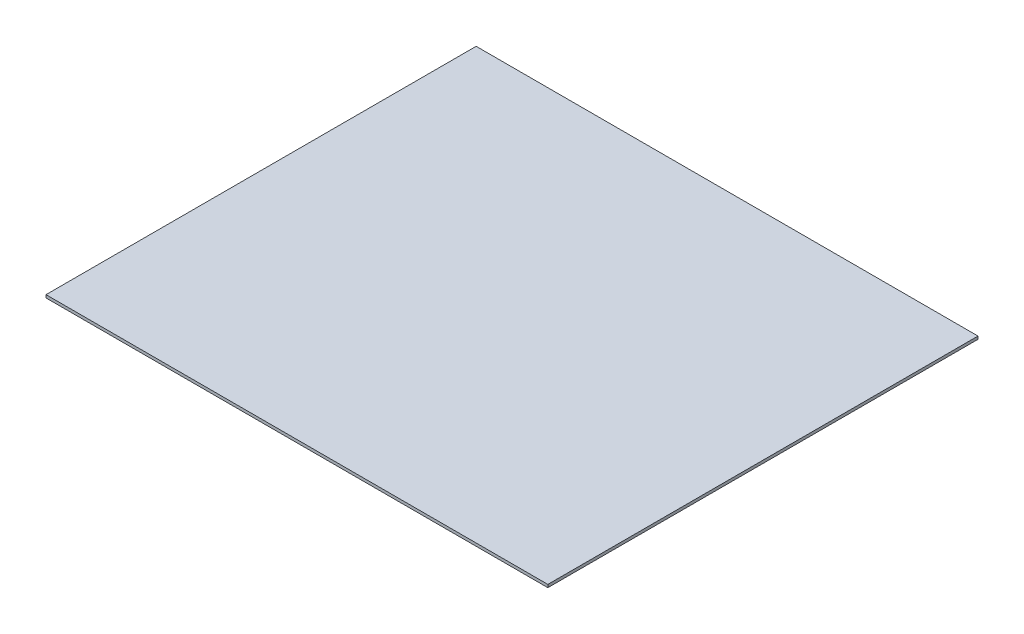
ISO-10303-21;
HEADER;
FILE_DESCRIPTION(('STEP AP214'),'2;1');
FILE_NAME('part.step','',(''),(''),'','','');
FILE_SCHEMA(('AUTOMOTIVE_DESIGN { 1 0 10303 214 1 1 1 1 }'));
ENDSEC;
DATA;
#1=APPLICATION_CONTEXT('core data for automotive mechanical design processes');
#2=APPLICATION_PROTOCOL_DEFINITION('international standard','automotive_design',2000,#1);
#3=PRODUCT_CONTEXT('',#1,'mechanical');
#4=PRODUCT('Part','Part','',(#3));
#5=PRODUCT_RELATED_PRODUCT_CATEGORY('part','',(#4));
#6=PRODUCT_DEFINITION_FORMATION('','',#4);
#7=PRODUCT_DEFINITION_CONTEXT('part definition',#1,'design');
#8=PRODUCT_DEFINITION('design','',#6,#7);
#9=PRODUCT_DEFINITION_SHAPE('','',#8);
#10=(LENGTH_UNIT() NAMED_UNIT(*) SI_UNIT(.MILLI.,.METRE.));
#11=(NAMED_UNIT(*) PLANE_ANGLE_UNIT() SI_UNIT($,.RADIAN.));
#12=(NAMED_UNIT(*) SI_UNIT($,.STERADIAN.) SOLID_ANGLE_UNIT());
#13=UNCERTAINTY_MEASURE_WITH_UNIT(LENGTH_MEASURE(1.E-05),#10,'distance_accuracy_value','');
#14=(GEOMETRIC_REPRESENTATION_CONTEXT(3) GLOBAL_UNCERTAINTY_ASSIGNED_CONTEXT((#13)) GLOBAL_UNIT_ASSIGNED_CONTEXT((#10,
#11,#12)) REPRESENTATION_CONTEXT('',''));
#15=CARTESIAN_POINT('',(0.,0.,0.));
#16=DIRECTION('',(0.,0.,1.));
#17=DIRECTION('',(1.,0.,0.));
#18=AXIS2_PLACEMENT_3D('',#15,#16,#17);
#19=CARTESIAN_POINT('',(0.,4.,0.));
#20=DIRECTION('',(1.,0.,0.));
#21=DIRECTION('',(0.,0.,-1.));
#22=AXIS2_PLACEMENT_3D('',#19,#20,#21);
#23=PLANE('',#22);
#24=DIRECTION('',(0.,0.,1.));
#25=VECTOR('',#24,1.);
#26=CARTESIAN_POINT('',(0.,0.,0.));
#27=LINE('',#26,#25);
#28=CARTESIAN_POINT('',(0.,0.,-600.));
#29=VERTEX_POINT('',#28);
#30=CARTESIAN_POINT('',(0.,0.,0.));
#31=VERTEX_POINT('',#30);
#32=EDGE_CURVE('E96',#29,#31,#27,.T.);
#33=ORIENTED_EDGE('',*,*,#32,.T.);
#34=DIRECTION('',(0.,-1.,0.));
#35=VECTOR('',#34,1.);
#36=CARTESIAN_POINT('',(0.,4.,0.));
#37=LINE('',#36,#35);
#38=CARTESIAN_POINT('',(0.,4.,0.));
#39=VERTEX_POINT('',#38);
#40=EDGE_CURVE('E11',#39,#31,#37,.T.);
#41=ORIENTED_EDGE('',*,*,#40,.F.);
#42=DIRECTION('',(0.,0.,1.));
#43=VECTOR('',#42,1.);
#44=CARTESIAN_POINT('',(0.,4.,0.));
#45=LINE('',#44,#43);
#46=CARTESIAN_POINT('',(0.,4.,-600.));
#47=VERTEX_POINT('',#46);
#48=EDGE_CURVE('E84',#47,#39,#45,.T.);
#49=ORIENTED_EDGE('',*,*,#48,.F.);
#50=DIRECTION('',(0.,-1.,0.));
#51=VECTOR('',#50,1.);
#52=CARTESIAN_POINT('',(0.,4.,-600.));
#53=LINE('',#52,#51);
#54=EDGE_CURVE('E92',#47,#29,#53,.T.);
#55=ORIENTED_EDGE('',*,*,#54,.T.);
#56=EDGE_LOOP('',(#33,#41,#49,#55));
#57=FACE_BOUND('',#56,.T.);
#58=ADVANCED_FACE('F33',(#57),#23,.F.);
#59=CARTESIAN_POINT('',(0.,4.,0.));
#60=DIRECTION('',(0.,0.,-1.));
#61=DIRECTION('',(-1.,0.,0.));
#62=AXIS2_PLACEMENT_3D('',#59,#60,#61);
#63=PLANE('',#62);
#64=DIRECTION('',(1.,0.,0.));
#65=VECTOR('',#64,1.);
#66=CARTESIAN_POINT('',(0.,0.,0.));
#67=LINE('',#66,#65);
#68=CARTESIAN_POINT('',(699.999999999999,0.,0.));
#69=VERTEX_POINT('',#68);
#70=EDGE_CURVE('E88',#31,#69,#67,.T.);
#71=ORIENTED_EDGE('',*,*,#70,.T.);
#72=DIRECTION('',(0.,-1.,0.));
#73=VECTOR('',#72,1.);
#74=CARTESIAN_POINT('',(699.999999999999,4.,0.));
#75=LINE('',#74,#73);
#76=CARTESIAN_POINT('',(699.999999999999,4.,0.));
#77=VERTEX_POINT('',#76);
#78=EDGE_CURVE('E41',#77,#69,#75,.T.);
#79=ORIENTED_EDGE('',*,*,#78,.F.);
#80=DIRECTION('',(1.,0.,0.));
#81=VECTOR('',#80,1.);
#82=CARTESIAN_POINT('',(0.,4.,0.));
#83=LINE('',#82,#81);
#84=EDGE_CURVE('E79',#39,#77,#83,.T.);
#85=ORIENTED_EDGE('',*,*,#84,.F.);
#86=ORIENTED_EDGE('',*,*,#40,.T.);
#87=EDGE_LOOP('',(#71,#79,#85,#86));
#88=FACE_BOUND('',#87,.T.);
#89=ADVANCED_FACE('F87',(#88),#63,.F.);
#90=CARTESIAN_POINT('',(699.999999999999,4.,0.));
#91=DIRECTION('',(-1.,0.,0.));
#92=DIRECTION('',(0.,0.,1.));
#93=AXIS2_PLACEMENT_3D('',#90,#91,#92);
#94=PLANE('',#93);
#95=DIRECTION('',(0.,0.,-1.));
#96=VECTOR('',#95,1.);
#97=CARTESIAN_POINT('',(699.999999999999,0.,0.));
#98=LINE('',#97,#96);
#99=CARTESIAN_POINT('',(700.,0.,-600.));
#100=VERTEX_POINT('',#99);
#101=EDGE_CURVE('E66',#69,#100,#98,.T.);
#102=ORIENTED_EDGE('',*,*,#101,.T.);
#103=DIRECTION('',(0.,-1.,0.));
#104=VECTOR('',#103,1.);
#105=CARTESIAN_POINT('',(700.,4.,-600.));
#106=LINE('',#105,#104);
#107=CARTESIAN_POINT('',(700.,4.,-600.));
#108=VERTEX_POINT('',#107);
#109=EDGE_CURVE('E89',#108,#100,#106,.T.);
#110=ORIENTED_EDGE('',*,*,#109,.F.);
#111=DIRECTION('',(0.,0.,-1.));
#112=VECTOR('',#111,1.);
#113=CARTESIAN_POINT('',(699.999999999999,4.,0.));
#114=LINE('',#113,#112);
#115=EDGE_CURVE('E82',#77,#108,#114,.T.);
#116=ORIENTED_EDGE('',*,*,#115,.F.);
#117=ORIENTED_EDGE('',*,*,#78,.T.);
#118=EDGE_LOOP('',(#102,#110,#116,#117));
#119=FACE_BOUND('',#118,.T.);
#120=ADVANCED_FACE('F90',(#119),#94,.F.);
#121=CARTESIAN_POINT('',(0.,4.,-600.));
#122=DIRECTION('',(0.,0.,1.));
#123=DIRECTION('',(1.,0.,0.));
#124=AXIS2_PLACEMENT_3D('',#121,#122,#123);
#125=PLANE('',#124);
#126=DIRECTION('',(-1.,0.,0.));
#127=VECTOR('',#126,1.);
#128=CARTESIAN_POINT('',(0.,0.,-600.));
#129=LINE('',#128,#127);
#130=EDGE_CURVE('E72',#100,#29,#129,.T.);
#131=ORIENTED_EDGE('',*,*,#130,.T.);
#132=ORIENTED_EDGE('',*,*,#54,.F.);
#133=DIRECTION('',(-1.,0.,0.));
#134=VECTOR('',#133,1.);
#135=CARTESIAN_POINT('',(0.,4.,-600.));
#136=LINE('',#135,#134);
#137=EDGE_CURVE('E49',#108,#47,#136,.T.);
#138=ORIENTED_EDGE('',*,*,#137,.F.);
#139=ORIENTED_EDGE('',*,*,#109,.T.);
#140=EDGE_LOOP('',(#131,#132,#138,#139));
#141=FACE_BOUND('',#140,.T.);
#142=ADVANCED_FACE('F103',(#141),#125,.F.);
#143=CARTESIAN_POINT('',(0.,4.,0.));
#144=DIRECTION('',(0.,-1.,0.));
#145=DIRECTION('',(0.,0.,-1.));
#146=AXIS2_PLACEMENT_3D('',#143,#144,#145);
#147=PLANE('',#146);
#148=ORIENTED_EDGE('',*,*,#48,.T.);
#149=ORIENTED_EDGE('',*,*,#84,.T.);
#150=ORIENTED_EDGE('',*,*,#115,.T.);
#151=ORIENTED_EDGE('',*,*,#137,.T.);
#152=EDGE_LOOP('',(#148,#149,#150,#151));
#153=FACE_BOUND('',#152,.T.);
#154=ADVANCED_FACE('F80',(#153),#147,.F.);
#155=CARTESIAN_POINT('',(0.,0.,0.));
#156=DIRECTION('',(0.,-1.,0.));
#157=DIRECTION('',(0.,0.,-1.));
#158=AXIS2_PLACEMENT_3D('',#155,#156,#157);
#159=PLANE('',#158);
#160=ORIENTED_EDGE('',*,*,#32,.F.);
#161=ORIENTED_EDGE('',*,*,#130,.F.);
#162=ORIENTED_EDGE('',*,*,#101,.F.);
#163=ORIENTED_EDGE('',*,*,#70,.F.);
#164=EDGE_LOOP('',(#160,#161,#162,#163));
#165=FACE_BOUND('',#164,.T.);
#166=ADVANCED_FACE('F106',(#165),#159,.T.);
#167=CLOSED_SHELL('',(#58,#89,#120,#142,#154,#166));
#168=MANIFOLD_SOLID_BREP('B2',#167);
#169=ADVANCED_BREP_SHAPE_REPRESENTATION('',(#18,#168),#14);
#170=SHAPE_DEFINITION_REPRESENTATION(#9,#169);
ENDSEC;
END-ISO-10303-21;
